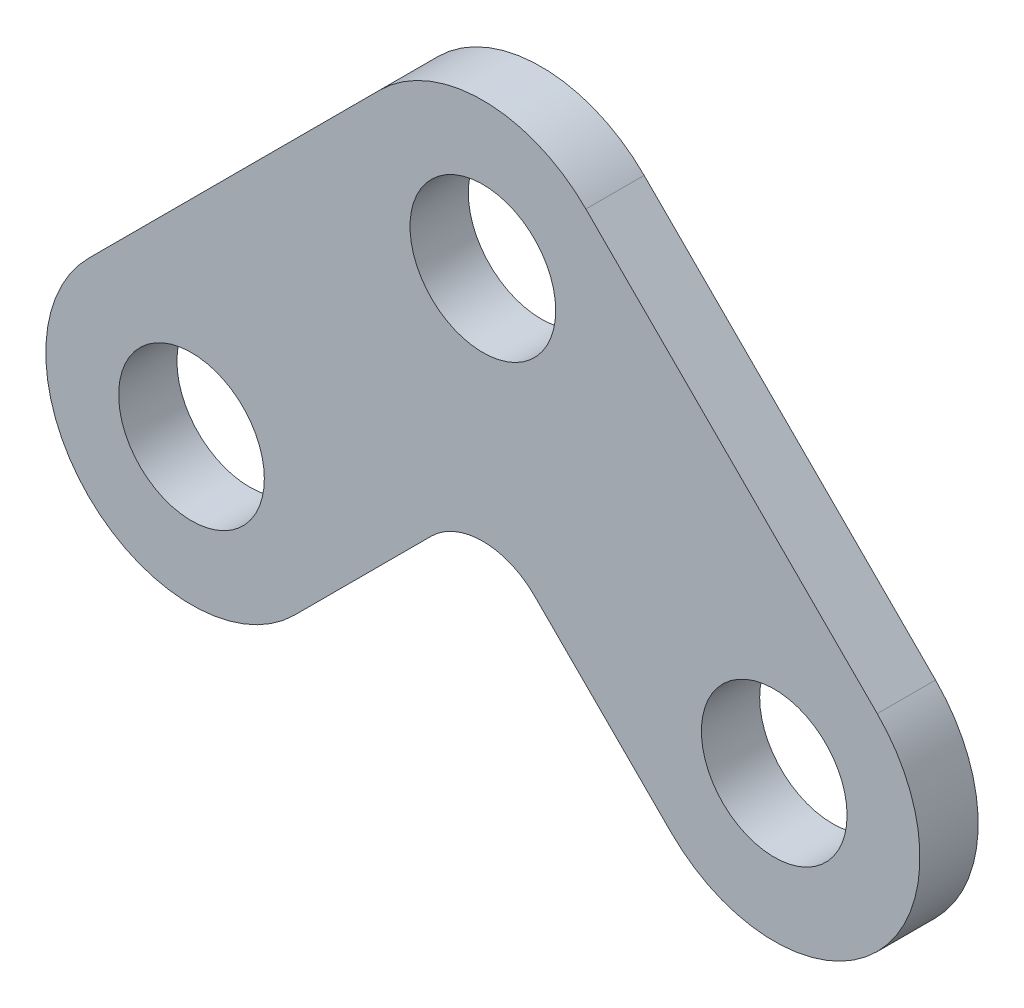
ISO-10303-21;
HEADER;
FILE_DESCRIPTION(('STEP AP214'),'2;1');
FILE_NAME('part.step','',(''),(''),'','','');
FILE_SCHEMA(('AUTOMOTIVE_DESIGN { 1 0 10303 214 1 1 1 1 }'));
ENDSEC;
DATA;
#1=APPLICATION_CONTEXT('core data for automotive mechanical design processes');
#2=APPLICATION_PROTOCOL_DEFINITION('international standard','automotive_design',2000,#1);
#3=PRODUCT_CONTEXT('',#1,'mechanical');
#4=PRODUCT('Part','Part','',(#3));
#5=PRODUCT_RELATED_PRODUCT_CATEGORY('part','',(#4));
#6=PRODUCT_DEFINITION_FORMATION('','',#4);
#7=PRODUCT_DEFINITION_CONTEXT('part definition',#1,'design');
#8=PRODUCT_DEFINITION('design','',#6,#7);
#9=PRODUCT_DEFINITION_SHAPE('','',#8);
#10=(LENGTH_UNIT() NAMED_UNIT(*) SI_UNIT(.MILLI.,.METRE.));
#11=(NAMED_UNIT(*) PLANE_ANGLE_UNIT() SI_UNIT($,.RADIAN.));
#12=(NAMED_UNIT(*) SI_UNIT($,.STERADIAN.) SOLID_ANGLE_UNIT());
#13=UNCERTAINTY_MEASURE_WITH_UNIT(LENGTH_MEASURE(1.E-05),#10,'distance_accuracy_value','');
#14=(GEOMETRIC_REPRESENTATION_CONTEXT(3) GLOBAL_UNCERTAINTY_ASSIGNED_CONTEXT((#13)) GLOBAL_UNIT_ASSIGNED_CONTEXT((#10,
#11,#12)) REPRESENTATION_CONTEXT('',''));
#15=CARTESIAN_POINT('',(0.,0.,0.));
#16=DIRECTION('',(0.,0.,1.));
#17=DIRECTION('',(1.,0.,0.));
#18=AXIS2_PLACEMENT_3D('',#15,#16,#17);
#19=CARTESIAN_POINT('',(0.,-14.142135623731,-4.));
#20=DIRECTION('',(-0.707106781186548,-0.707106781186547,0.));
#21=DIRECTION('',(0.707106781186547,-0.707106781186548,0.));
#22=AXIS2_PLACEMENT_3D('',#19,#20,#21);
#23=PLANE('',#22);
#24=DIRECTION('',(0.707106781186547,-0.707106781186548,0.));
#25=VECTOR('',#24,1.);
#26=CARTESIAN_POINT('',(0.,-14.142135623731,0.));
#27=LINE('',#26,#25);
#28=CARTESIAN_POINT('',(3.53553390593274,-17.6776695296637,0.));
#29=VERTEX_POINT('',#28);
#30=CARTESIAN_POINT('',(12.9289321881345,-27.0710678118655,0.));
#31=VERTEX_POINT('',#30);
#32=EDGE_CURVE('E138',#29,#31,#27,.T.);
#33=ORIENTED_EDGE('',*,*,#32,.F.);
#34=DIRECTION('',(0.,0.,1.));
#35=VECTOR('',#34,1.);
#36=CARTESIAN_POINT('',(3.53553390593274,-17.6776695296637,-4.));
#37=LINE('',#36,#35);
#38=CARTESIAN_POINT('',(3.53553390593274,-17.6776695296637,-4.));
#39=VERTEX_POINT('',#38);
#40=EDGE_CURVE('E54',#29,#39,#37,.F.);
#41=ORIENTED_EDGE('',*,*,#40,.T.);
#42=DIRECTION('',(0.707106781186547,-0.707106781186548,0.));
#43=VECTOR('',#42,1.);
#44=CARTESIAN_POINT('',(0.,-14.142135623731,-4.));
#45=LINE('',#44,#43);
#46=CARTESIAN_POINT('',(12.9289321881345,-27.0710678118655,-4.));
#47=VERTEX_POINT('',#46);
#48=EDGE_CURVE('E100',#39,#47,#45,.T.);
#49=ORIENTED_EDGE('',*,*,#48,.T.);
#50=DIRECTION('',(0.,0.,1.));
#51=VECTOR('',#50,1.);
#52=CARTESIAN_POINT('',(12.9289321881345,-27.0710678118655,-4.));
#53=LINE('',#52,#51);
#54=EDGE_CURVE('E102',#47,#31,#53,.T.);
#55=ORIENTED_EDGE('',*,*,#54,.T.);
#56=EDGE_LOOP('',(#33,#41,#49,#55));
#57=FACE_BOUND('',#56,.T.);
#58=ADVANCED_FACE('F39',(#57),#23,.T.);
#59=CARTESIAN_POINT('',(0.,-14.142135623731,-4.));
#60=DIRECTION('',(0.707106781186548,-0.707106781186547,0.));
#61=DIRECTION('',(0.707106781186547,0.707106781186548,0.));
#62=AXIS2_PLACEMENT_3D('',#59,#60,#61);
#63=PLANE('',#62);
#64=DIRECTION('',(0.707106781186547,0.707106781186548,0.));
#65=VECTOR('',#64,1.);
#66=CARTESIAN_POINT('',(0.,-14.142135623731,-4.));
#67=LINE('',#66,#65);
#68=CARTESIAN_POINT('',(-12.9289321881345,-27.0710678118655,-4.));
#69=VERTEX_POINT('',#68);
#70=CARTESIAN_POINT('',(-3.53553390593274,-17.6776695296637,-4.));
#71=VERTEX_POINT('',#70);
#72=EDGE_CURVE('E116',#69,#71,#67,.T.);
#73=ORIENTED_EDGE('',*,*,#72,.T.);
#74=DIRECTION('',(0.,0.,1.));
#75=VECTOR('',#74,1.);
#76=CARTESIAN_POINT('',(-3.53553390593274,-17.6776695296637,0.));
#77=LINE('',#76,#75);
#78=CARTESIAN_POINT('',(-3.53553390593274,-17.6776695296637,0.));
#79=VERTEX_POINT('',#78);
#80=EDGE_CURVE('E157',#71,#79,#77,.T.);
#81=ORIENTED_EDGE('',*,*,#80,.T.);
#82=DIRECTION('',(0.707106781186547,0.707106781186548,0.));
#83=VECTOR('',#82,1.);
#84=CARTESIAN_POINT('',(0.,-14.142135623731,0.));
#85=LINE('',#84,#83);
#86=CARTESIAN_POINT('',(-12.9289321881345,-27.0710678118655,0.));
#87=VERTEX_POINT('',#86);
#88=EDGE_CURVE('E108',#87,#79,#85,.T.);
#89=ORIENTED_EDGE('',*,*,#88,.F.);
#90=DIRECTION('',(0.,0.,1.));
#91=VECTOR('',#90,1.);
#92=CARTESIAN_POINT('',(-12.9289321881345,-27.0710678118655,-4.));
#93=LINE('',#92,#91);
#94=EDGE_CURVE('E155',#69,#87,#93,.T.);
#95=ORIENTED_EDGE('',*,*,#94,.F.);
#96=EDGE_LOOP('',(#73,#81,#89,#95));
#97=FACE_BOUND('',#96,.T.);
#98=ADVANCED_FACE('F170',(#97),#63,.T.);
#99=CARTESIAN_POINT('',(-20.,-20.,-4.));
#100=DIRECTION('',(0.,0.,1.));
#101=DIRECTION('',(1.,0.,0.));
#102=AXIS2_PLACEMENT_3D('',#99,#100,#101);
#103=CYLINDRICAL_SURFACE('',#102,10.);
#104=CARTESIAN_POINT('',(-20.,-20.,0.));
#105=DIRECTION('',(0.,0.,1.));
#106=DIRECTION('',(1.,0.,0.));
#107=AXIS2_PLACEMENT_3D('',#104,#105,#106);
#108=CIRCLE('',#107,10.);
#109=CARTESIAN_POINT('',(-27.0710678118655,-12.9289321881345,0.));
#110=VERTEX_POINT('',#109);
#111=EDGE_CURVE('E151',#110,#87,#108,.T.);
#112=ORIENTED_EDGE('',*,*,#111,.F.);
#113=DIRECTION('',(0.,0.,1.));
#114=VECTOR('',#113,1.);
#115=CARTESIAN_POINT('',(-27.0710678118655,-12.9289321881345,-4.));
#116=LINE('',#115,#114);
#117=CARTESIAN_POINT('',(-27.0710678118655,-12.9289321881345,-4.));
#118=VERTEX_POINT('',#117);
#119=EDGE_CURVE('E158',#118,#110,#116,.T.);
#120=ORIENTED_EDGE('',*,*,#119,.F.);
#121=CARTESIAN_POINT('',(-20.,-20.,-4.));
#122=DIRECTION('',(0.,0.,1.));
#123=DIRECTION('',(1.,0.,0.));
#124=AXIS2_PLACEMENT_3D('',#121,#122,#123);
#125=CIRCLE('',#124,10.);
#126=EDGE_CURVE('E133',#118,#69,#125,.T.);
#127=ORIENTED_EDGE('',*,*,#126,.T.);
#128=ORIENTED_EDGE('',*,*,#94,.T.);
#129=EDGE_LOOP('',(#112,#120,#127,#128));
#130=FACE_BOUND('',#129,.T.);
#131=ADVANCED_FACE('F177',(#130),#103,.T.);
#132=CARTESIAN_POINT('',(-7.07106781186548,7.07106781186548,-4.));
#133=DIRECTION('',(-0.707106781186547,0.707106781186548,0.));
#134=DIRECTION('',(-0.707106781186548,-0.707106781186547,0.));
#135=AXIS2_PLACEMENT_3D('',#132,#133,#134);
#136=PLANE('',#135);
#137=DIRECTION('',(-0.707106781186548,-0.707106781186547,0.));
#138=VECTOR('',#137,1.);
#139=CARTESIAN_POINT('',(-7.07106781186548,7.07106781186548,0.));
#140=LINE('',#139,#138);
#141=CARTESIAN_POINT('',(-7.07106781186548,7.07106781186548,0.));
#142=VERTEX_POINT('',#141);
#143=EDGE_CURVE('E148',#142,#110,#140,.T.);
#144=ORIENTED_EDGE('',*,*,#143,.F.);
#145=DIRECTION('',(0.,0.,1.));
#146=VECTOR('',#145,1.);
#147=CARTESIAN_POINT('',(-7.07106781186548,7.07106781186548,-4.));
#148=LINE('',#147,#146);
#149=CARTESIAN_POINT('',(-7.07106781186548,7.07106781186548,-4.));
#150=VERTEX_POINT('',#149);
#151=EDGE_CURVE('E160',#150,#142,#148,.T.);
#152=ORIENTED_EDGE('',*,*,#151,.F.);
#153=DIRECTION('',(-0.707106781186548,-0.707106781186547,0.));
#154=VECTOR('',#153,1.);
#155=CARTESIAN_POINT('',(-7.07106781186548,7.07106781186548,-4.));
#156=LINE('',#155,#154);
#157=EDGE_CURVE('E130',#150,#118,#156,.T.);
#158=ORIENTED_EDGE('',*,*,#157,.T.);
#159=ORIENTED_EDGE('',*,*,#119,.T.);
#160=EDGE_LOOP('',(#144,#152,#158,#159));
#161=FACE_BOUND('',#160,.T.);
#162=ADVANCED_FACE('F203',(#161),#136,.T.);
#163=CARTESIAN_POINT('',(0.,0.,-4.));
#164=DIRECTION('',(0.,0.,1.));
#165=DIRECTION('',(1.,0.,0.));
#166=AXIS2_PLACEMENT_3D('',#163,#164,#165);
#167=CYLINDRICAL_SURFACE('',#166,10.);
#168=CARTESIAN_POINT('',(0.,0.,0.));
#169=DIRECTION('',(0.,0.,1.));
#170=DIRECTION('',(1.,0.,0.));
#171=AXIS2_PLACEMENT_3D('',#168,#169,#170);
#172=CIRCLE('',#171,10.);
#173=CARTESIAN_POINT('',(7.07106781186548,7.07106781186548,0.));
#174=VERTEX_POINT('',#173);
#175=EDGE_CURVE('E145',#174,#142,#172,.T.);
#176=ORIENTED_EDGE('',*,*,#175,.F.);
#177=DIRECTION('',(0.,0.,1.));
#178=VECTOR('',#177,1.);
#179=CARTESIAN_POINT('',(7.07106781186548,7.07106781186548,-4.));
#180=LINE('',#179,#178);
#181=CARTESIAN_POINT('',(7.07106781186548,7.07106781186548,-4.));
#182=VERTEX_POINT('',#181);
#183=EDGE_CURVE('E162',#182,#174,#180,.T.);
#184=ORIENTED_EDGE('',*,*,#183,.F.);
#185=CARTESIAN_POINT('',(0.,0.,-4.));
#186=DIRECTION('',(0.,0.,1.));
#187=DIRECTION('',(1.,0.,0.));
#188=AXIS2_PLACEMENT_3D('',#185,#186,#187);
#189=CIRCLE('',#188,10.);
#190=EDGE_CURVE('E124',#182,#150,#189,.T.);
#191=ORIENTED_EDGE('',*,*,#190,.T.);
#192=ORIENTED_EDGE('',*,*,#151,.T.);
#193=EDGE_LOOP('',(#176,#184,#191,#192));
#194=FACE_BOUND('',#193,.T.);
#195=ADVANCED_FACE('F199',(#194),#167,.T.);
#196=CARTESIAN_POINT('',(7.07106781186548,7.07106781186548,-4.));
#197=DIRECTION('',(0.707106781186547,0.707106781186548,0.));
#198=DIRECTION('',(-0.707106781186548,0.707106781186547,0.));
#199=AXIS2_PLACEMENT_3D('',#196,#197,#198);
#200=PLANE('',#199);
#201=DIRECTION('',(-0.707106781186548,0.707106781186547,0.));
#202=VECTOR('',#201,1.);
#203=CARTESIAN_POINT('',(7.07106781186548,7.07106781186548,0.));
#204=LINE('',#203,#202);
#205=CARTESIAN_POINT('',(27.0710678118655,-12.9289321881345,0.));
#206=VERTEX_POINT('',#205);
#207=EDGE_CURVE('E142',#206,#174,#204,.T.);
#208=ORIENTED_EDGE('',*,*,#207,.F.);
#209=DIRECTION('',(0.,0.,1.));
#210=VECTOR('',#209,1.);
#211=CARTESIAN_POINT('',(27.0710678118655,-12.9289321881345,-4.));
#212=LINE('',#211,#210);
#213=CARTESIAN_POINT('',(27.0710678118655,-12.9289321881345,-4.));
#214=VERTEX_POINT('',#213);
#215=EDGE_CURVE('E115',#214,#206,#212,.T.);
#216=ORIENTED_EDGE('',*,*,#215,.F.);
#217=DIRECTION('',(-0.707106781186548,0.707106781186547,0.));
#218=VECTOR('',#217,1.);
#219=CARTESIAN_POINT('',(7.07106781186548,7.07106781186548,-4.));
#220=LINE('',#219,#218);
#221=EDGE_CURVE('E122',#214,#182,#220,.T.);
#222=ORIENTED_EDGE('',*,*,#221,.T.);
#223=ORIENTED_EDGE('',*,*,#183,.T.);
#224=EDGE_LOOP('',(#208,#216,#222,#223));
#225=FACE_BOUND('',#224,.T.);
#226=ADVANCED_FACE('F196',(#225),#200,.T.);
#227=CARTESIAN_POINT('',(20.,-20.,-4.));
#228=DIRECTION('',(0.,0.,1.));
#229=DIRECTION('',(1.,0.,0.));
#230=AXIS2_PLACEMENT_3D('',#227,#228,#229);
#231=CYLINDRICAL_SURFACE('',#230,10.);
#232=CARTESIAN_POINT('',(20.,-20.,0.));
#233=DIRECTION('',(0.,0.,1.));
#234=DIRECTION('',(-1.,0.,0.));
#235=AXIS2_PLACEMENT_3D('',#232,#233,#234);
#236=CIRCLE('',#235,10.);
#237=EDGE_CURVE('E114',#31,#206,#236,.T.);
#238=ORIENTED_EDGE('',*,*,#237,.F.);
#239=ORIENTED_EDGE('',*,*,#54,.F.);
#240=CARTESIAN_POINT('',(20.,-20.,-4.));
#241=DIRECTION('',(0.,0.,1.));
#242=DIRECTION('',(-1.,0.,0.));
#243=AXIS2_PLACEMENT_3D('',#240,#241,#242);
#244=CIRCLE('',#243,10.);
#245=EDGE_CURVE('E107',#47,#214,#244,.T.);
#246=ORIENTED_EDGE('',*,*,#245,.T.);
#247=ORIENTED_EDGE('',*,*,#215,.T.);
#248=EDGE_LOOP('',(#238,#239,#246,#247));
#249=FACE_BOUND('',#248,.T.);
#250=ADVANCED_FACE('F112',(#249),#231,.T.);
#251=CARTESIAN_POINT('',(20.,-20.,-4.));
#252=DIRECTION('',(0.,0.,-1.));
#253=DIRECTION('',(-1.,0.,0.));
#254=AXIS2_PLACEMENT_3D('',#251,#252,#253);
#255=PLANE('',#254);
#256=CARTESIAN_POINT('',(0.,0.,-4.));
#257=DIRECTION('',(0.,0.,-1.));
#258=DIRECTION('',(-1.,0.,0.));
#259=AXIS2_PLACEMENT_3D('',#256,#257,#258);
#260=CIRCLE('',#259,5.);
#261=CARTESIAN_POINT('',(-5.,0.,-4.));
#262=VERTEX_POINT('',#261);
#263=EDGE_CURVE('E140',#262,#262,#260,.T.);
#264=ORIENTED_EDGE('',*,*,#263,.F.);
#265=EDGE_LOOP('',(#264));
#266=FACE_BOUND('',#265,.T.);
#267=CARTESIAN_POINT('',(-20.,-20.,-4.));
#268=DIRECTION('',(0.,0.,-1.));
#269=DIRECTION('',(-1.,0.,0.));
#270=AXIS2_PLACEMENT_3D('',#267,#268,#269);
#271=CIRCLE('',#270,5.);
#272=CARTESIAN_POINT('',(-25.,-20.,-4.));
#273=VERTEX_POINT('',#272);
#274=EDGE_CURVE('E227',#273,#273,#271,.T.);
#275=ORIENTED_EDGE('',*,*,#274,.F.);
#276=EDGE_LOOP('',(#275));
#277=FACE_BOUND('',#276,.T.);
#278=CARTESIAN_POINT('',(20.,-20.,-4.));
#279=DIRECTION('',(0.,0.,-1.));
#280=DIRECTION('',(-1.,0.,0.));
#281=AXIS2_PLACEMENT_3D('',#278,#279,#280);
#282=CIRCLE('',#281,5.);
#283=CARTESIAN_POINT('',(15.,-20.,-4.));
#284=VERTEX_POINT('',#283);
#285=EDGE_CURVE('E236',#284,#284,#282,.T.);
#286=ORIENTED_EDGE('',*,*,#285,.F.);
#287=EDGE_LOOP('',(#286));
#288=FACE_BOUND('',#287,.T.);
#289=ORIENTED_EDGE('',*,*,#48,.F.);
#290=CARTESIAN_POINT('',(0.,-21.2132034355964,-4.));
#291=DIRECTION('',(0.,0.,-1.));
#292=DIRECTION('',(-1.,0.,0.));
#293=AXIS2_PLACEMENT_3D('',#290,#291,#292);
#294=CIRCLE('',#293,5.);
#295=EDGE_CURVE('E11',#39,#71,#294,.F.);
#296=ORIENTED_EDGE('',*,*,#295,.T.);
#297=ORIENTED_EDGE('',*,*,#72,.F.);
#298=ORIENTED_EDGE('',*,*,#126,.F.);
#299=ORIENTED_EDGE('',*,*,#157,.F.);
#300=ORIENTED_EDGE('',*,*,#190,.F.);
#301=ORIENTED_EDGE('',*,*,#221,.F.);
#302=ORIENTED_EDGE('',*,*,#245,.F.);
#303=EDGE_LOOP('',(#289,#296,#297,#298,#299,#300,#301,#302));
#304=FACE_BOUND('',#303,.T.);
#305=ADVANCED_FACE('F119',(#266,#277,#288,#304),#255,.T.);
#306=CARTESIAN_POINT('',(20.,-20.,0.));
#307=DIRECTION('',(0.,0.,-1.));
#308=DIRECTION('',(-1.,0.,0.));
#309=AXIS2_PLACEMENT_3D('',#306,#307,#308);
#310=PLANE('',#309);
#311=CARTESIAN_POINT('',(0.,0.,0.));
#312=DIRECTION('',(0.,0.,1.));
#313=DIRECTION('',(1.,0.,0.));
#314=AXIS2_PLACEMENT_3D('',#311,#312,#313);
#315=CIRCLE('',#314,5.);
#316=CARTESIAN_POINT('',(5.,0.,0.));
#317=VERTEX_POINT('',#316);
#318=EDGE_CURVE('E232',#317,#317,#315,.T.);
#319=ORIENTED_EDGE('',*,*,#318,.F.);
#320=EDGE_LOOP('',(#319));
#321=FACE_BOUND('',#320,.T.);
#322=CARTESIAN_POINT('',(-20.,-20.,0.));
#323=DIRECTION('',(0.,0.,1.));
#324=DIRECTION('',(1.,0.,0.));
#325=AXIS2_PLACEMENT_3D('',#322,#323,#324);
#326=CIRCLE('',#325,5.);
#327=CARTESIAN_POINT('',(-15.,-20.,0.));
#328=VERTEX_POINT('',#327);
#329=EDGE_CURVE('E230',#328,#328,#326,.T.);
#330=ORIENTED_EDGE('',*,*,#329,.F.);
#331=EDGE_LOOP('',(#330));
#332=FACE_BOUND('',#331,.T.);
#333=CARTESIAN_POINT('',(20.,-20.,0.));
#334=DIRECTION('',(0.,0.,1.));
#335=DIRECTION('',(1.,0.,0.));
#336=AXIS2_PLACEMENT_3D('',#333,#334,#335);
#337=CIRCLE('',#336,5.);
#338=CARTESIAN_POINT('',(25.,-20.,0.));
#339=VERTEX_POINT('',#338);
#340=EDGE_CURVE('E233',#339,#339,#337,.T.);
#341=ORIENTED_EDGE('',*,*,#340,.F.);
#342=EDGE_LOOP('',(#341));
#343=FACE_BOUND('',#342,.T.);
#344=ORIENTED_EDGE('',*,*,#88,.T.);
#345=CARTESIAN_POINT('',(0.,-21.2132034355964,0.));
#346=DIRECTION('',(0.,0.,-1.));
#347=DIRECTION('',(-1.,0.,0.));
#348=AXIS2_PLACEMENT_3D('',#345,#346,#347);
#349=CIRCLE('',#348,5.);
#350=EDGE_CURVE('E47',#79,#29,#349,.T.);
#351=ORIENTED_EDGE('',*,*,#350,.T.);
#352=ORIENTED_EDGE('',*,*,#32,.T.);
#353=ORIENTED_EDGE('',*,*,#237,.T.);
#354=ORIENTED_EDGE('',*,*,#207,.T.);
#355=ORIENTED_EDGE('',*,*,#175,.T.);
#356=ORIENTED_EDGE('',*,*,#143,.T.);
#357=ORIENTED_EDGE('',*,*,#111,.T.);
#358=EDGE_LOOP('',(#344,#351,#352,#353,#354,#355,#356,#357));
#359=FACE_BOUND('',#358,.T.);
#360=ADVANCED_FACE('F173',(#321,#332,#343,#359),#310,.F.);
#361=CARTESIAN_POINT('',(20.,-20.,-10.));
#362=DIRECTION('',(0.,0.,1.));
#363=DIRECTION('',(1.,0.,0.));
#364=AXIS2_PLACEMENT_3D('',#361,#362,#363);
#365=CYLINDRICAL_SURFACE('',#364,5.);
#366=ORIENTED_EDGE('',*,*,#285,.T.);
#367=EDGE_LOOP('',(#366));
#368=FACE_BOUND('',#367,.T.);
#369=ORIENTED_EDGE('',*,*,#340,.T.);
#370=EDGE_LOOP('',(#369));
#371=FACE_BOUND('',#370,.T.);
#372=ADVANCED_FACE('F212',(#368,#371),#365,.F.);
#373=CARTESIAN_POINT('',(-20.,-20.,-10.));
#374=DIRECTION('',(0.,0.,1.));
#375=DIRECTION('',(1.,0.,0.));
#376=AXIS2_PLACEMENT_3D('',#373,#374,#375);
#377=CYLINDRICAL_SURFACE('',#376,5.);
#378=ORIENTED_EDGE('',*,*,#274,.T.);
#379=EDGE_LOOP('',(#378));
#380=FACE_BOUND('',#379,.T.);
#381=ORIENTED_EDGE('',*,*,#329,.T.);
#382=EDGE_LOOP('',(#381));
#383=FACE_BOUND('',#382,.T.);
#384=ADVANCED_FACE('F185',(#380,#383),#377,.F.);
#385=CARTESIAN_POINT('',(0.,0.,-10.));
#386=DIRECTION('',(0.,0.,1.));
#387=DIRECTION('',(1.,0.,0.));
#388=AXIS2_PLACEMENT_3D('',#385,#386,#387);
#389=CYLINDRICAL_SURFACE('',#388,5.);
#390=ORIENTED_EDGE('',*,*,#263,.T.);
#391=EDGE_LOOP('',(#390));
#392=FACE_BOUND('',#391,.T.);
#393=ORIENTED_EDGE('',*,*,#318,.T.);
#394=EDGE_LOOP('',(#393));
#395=FACE_BOUND('',#394,.T.);
#396=ADVANCED_FACE('F181',(#392,#395),#389,.F.);
#397=CARTESIAN_POINT('',(0.,-21.2132034355964,-4.));
#398=DIRECTION('',(0.,0.,-1.));
#399=DIRECTION('',(-1.,0.,0.));
#400=AXIS2_PLACEMENT_3D('',#397,#398,#399);
#401=CYLINDRICAL_SURFACE('',#400,5.);
#402=ORIENTED_EDGE('',*,*,#295,.F.);
#403=ORIENTED_EDGE('',*,*,#40,.F.);
#404=ORIENTED_EDGE('',*,*,#350,.F.);
#405=ORIENTED_EDGE('',*,*,#80,.F.);
#406=EDGE_LOOP('',(#402,#403,#404,#405));
#407=FACE_BOUND('',#406,.T.);
#408=ADVANCED_FACE('F41',(#407),#401,.F.);
#409=CLOSED_SHELL('',(#58,#98,#131,#162,#195,#226,#250,#305,#360,#372,#384,#396,#408));
#410=MANIFOLD_SOLID_BREP('B2',#409);
#411=ADVANCED_BREP_SHAPE_REPRESENTATION('',(#18,#410),#14);
#412=SHAPE_DEFINITION_REPRESENTATION(#9,#411);
ENDSEC;
END-ISO-10303-21;
